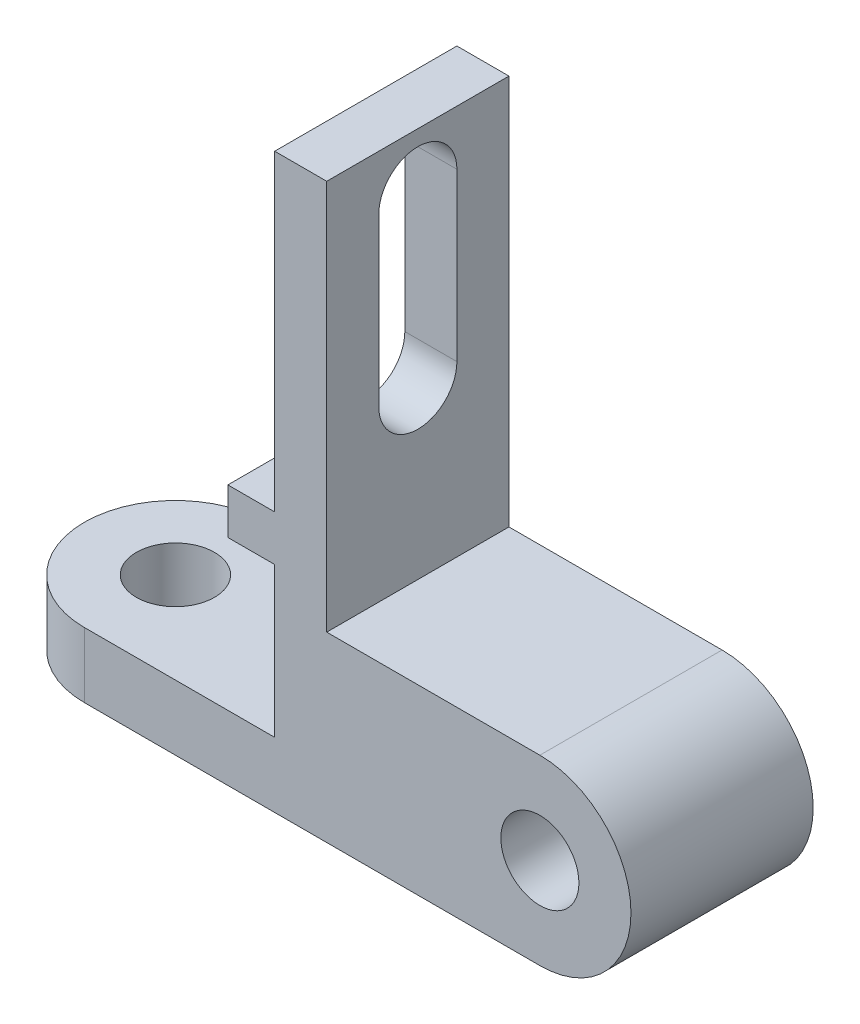
ISO-10303-21;
HEADER;
FILE_DESCRIPTION(('STEP AP214'),'2;1');
FILE_NAME('part.step','',(''),(''),'','','');
FILE_SCHEMA(('AUTOMOTIVE_DESIGN { 1 0 10303 214 1 1 1 1 }'));
ENDSEC;
DATA;
#1=APPLICATION_CONTEXT('core data for automotive mechanical design processes');
#2=APPLICATION_PROTOCOL_DEFINITION('international standard','automotive_design',2000,#1);
#3=PRODUCT_CONTEXT('',#1,'mechanical');
#4=PRODUCT('Part','Part','',(#3));
#5=PRODUCT_RELATED_PRODUCT_CATEGORY('part','',(#4));
#6=PRODUCT_DEFINITION_FORMATION('','',#4);
#7=PRODUCT_DEFINITION_CONTEXT('part definition',#1,'design');
#8=PRODUCT_DEFINITION('design','',#6,#7);
#9=PRODUCT_DEFINITION_SHAPE('','',#8);
#10=(LENGTH_UNIT() NAMED_UNIT(*) SI_UNIT(.MILLI.,.METRE.));
#11=(NAMED_UNIT(*) PLANE_ANGLE_UNIT() SI_UNIT($,.RADIAN.));
#12=(NAMED_UNIT(*) SI_UNIT($,.STERADIAN.) SOLID_ANGLE_UNIT());
#13=UNCERTAINTY_MEASURE_WITH_UNIT(LENGTH_MEASURE(1.E-05),#10,'distance_accuracy_value','');
#14=(GEOMETRIC_REPRESENTATION_CONTEXT(3) GLOBAL_UNCERTAINTY_ASSIGNED_CONTEXT((#13)) GLOBAL_UNIT_ASSIGNED_CONTEXT((#10,
#11,#12)) REPRESENTATION_CONTEXT('',''));
#15=CARTESIAN_POINT('',(0.,0.,0.));
#16=DIRECTION('',(0.,0.,1.));
#17=DIRECTION('',(1.,0.,0.));
#18=AXIS2_PLACEMENT_3D('',#15,#16,#17);
#19=CARTESIAN_POINT('',(0.,0.,14.));
#20=DIRECTION('',(0.,0.,1.));
#21=DIRECTION('',(1.,0.,0.));
#22=AXIS2_PLACEMENT_3D('',#19,#20,#21);
#23=PLANE('',#22);
#24=CARTESIAN_POINT('',(0.,0.,14.));
#25=DIRECTION('',(0.,0.,1.));
#26=DIRECTION('',(1.,0.,0.));
#27=AXIS2_PLACEMENT_3D('',#24,#25,#26);
#28=CIRCLE('',#27,14.);
#29=CARTESIAN_POINT('',(0.,-14.,14.));
#30=VERTEX_POINT('',#29);
#31=CARTESIAN_POINT('',(0.,14.,14.));
#32=VERTEX_POINT('',#31);
#33=EDGE_CURVE('E192',#30,#32,#28,.T.);
#34=ORIENTED_EDGE('',*,*,#33,.T.);
#35=DIRECTION('',(-1.,0.,0.));
#36=VECTOR('',#35,1.);
#37=CARTESIAN_POINT('',(-32.7493028128846,14.,14.));
#38=LINE('',#37,#36);
#39=CARTESIAN_POINT('',(-32.7493028128846,14.,14.));
#40=VERTEX_POINT('',#39);
#41=EDGE_CURVE('E195',#32,#40,#38,.T.);
#42=ORIENTED_EDGE('',*,*,#41,.T.);
#43=DIRECTION('',(0.,1.,0.));
#44=VECTOR('',#43,1.);
#45=CARTESIAN_POINT('',(-32.7493028128846,74.,14.));
#46=LINE('',#45,#44);
#47=CARTESIAN_POINT('',(-32.7493028128846,74.,14.));
#48=VERTEX_POINT('',#47);
#49=EDGE_CURVE('E198',#40,#48,#46,.T.);
#50=ORIENTED_EDGE('',*,*,#49,.T.);
#51=DIRECTION('',(-1.,0.,0.));
#52=VECTOR('',#51,1.);
#53=CARTESIAN_POINT('',(-40.7493028128846,74.,14.));
#54=LINE('',#53,#52);
#55=CARTESIAN_POINT('',(-40.7493028128846,74.,14.));
#56=VERTEX_POINT('',#55);
#57=EDGE_CURVE('E200',#48,#56,#54,.T.);
#58=ORIENTED_EDGE('',*,*,#57,.T.);
#59=DIRECTION('',(0.,-1.,0.));
#60=VECTOR('',#59,1.);
#61=CARTESIAN_POINT('',(-40.7493028128846,26.,14.));
#62=LINE('',#61,#60);
#63=CARTESIAN_POINT('',(-40.7493028128846,26.,14.));
#64=VERTEX_POINT('',#63);
#65=EDGE_CURVE('E202',#56,#64,#62,.T.);
#66=ORIENTED_EDGE('',*,*,#65,.T.);
#67=DIRECTION('',(-1.,0.,0.));
#68=VECTOR('',#67,1.);
#69=CARTESIAN_POINT('',(-47.9403562504525,26.,14.));
#70=LINE('',#69,#68);
#71=CARTESIAN_POINT('',(-47.9403562504525,26.,14.));
#72=VERTEX_POINT('',#71);
#73=EDGE_CURVE('E204',#64,#72,#70,.T.);
#74=ORIENTED_EDGE('',*,*,#73,.T.);
#75=DIRECTION('',(0.,-1.,0.));
#76=VECTOR('',#75,1.);
#77=CARTESIAN_POINT('',(-47.9403562504525,19.,14.));
#78=LINE('',#77,#76);
#79=CARTESIAN_POINT('',(-47.9403562504525,19.,14.));
#80=VERTEX_POINT('',#79);
#81=EDGE_CURVE('E206',#72,#80,#78,.T.);
#82=ORIENTED_EDGE('',*,*,#81,.T.);
#83=DIRECTION('',(1.,0.,0.));
#84=VECTOR('',#83,1.);
#85=CARTESIAN_POINT('',(-40.7493028128846,19.,14.));
#86=LINE('',#85,#84);
#87=CARTESIAN_POINT('',(-40.7493028128846,19.,14.));
#88=VERTEX_POINT('',#87);
#89=EDGE_CURVE('E208',#80,#88,#86,.T.);
#90=ORIENTED_EDGE('',*,*,#89,.T.);
#91=DIRECTION('',(0.,-1.,0.));
#92=VECTOR('',#91,1.);
#93=CARTESIAN_POINT('',(-40.7493028128846,-4.00000000000001,14.));
#94=LINE('',#93,#92);
#95=CARTESIAN_POINT('',(-40.7493028128846,-4.00000000000001,14.));
#96=VERTEX_POINT('',#95);
#97=EDGE_CURVE('E210',#88,#96,#94,.T.);
#98=ORIENTED_EDGE('',*,*,#97,.T.);
#99=DIRECTION('',(-1.,0.,0.));
#100=VECTOR('',#99,1.);
#101=CARTESIAN_POINT('',(-70.,-4.00000000000001,14.));
#102=LINE('',#101,#100);
#103=CARTESIAN_POINT('',(-70.,-4.00000000000001,14.));
#104=VERTEX_POINT('',#103);
#105=EDGE_CURVE('E212',#96,#104,#102,.T.);
#106=ORIENTED_EDGE('',*,*,#105,.T.);
#107=DIRECTION('',(0.,-1.,0.));
#108=VECTOR('',#107,1.);
#109=CARTESIAN_POINT('',(-70.,-14.,14.));
#110=LINE('',#109,#108);
#111=CARTESIAN_POINT('',(-70.,-14.,14.));
#112=VERTEX_POINT('',#111);
#113=EDGE_CURVE('E215',#104,#112,#110,.T.);
#114=ORIENTED_EDGE('',*,*,#113,.T.);
#115=DIRECTION('',(1.,0.,0.));
#116=VECTOR('',#115,1.);
#117=CARTESIAN_POINT('',(0.,-14.,14.));
#118=LINE('',#117,#116);
#119=EDGE_CURVE('E218',#112,#30,#118,.T.);
#120=ORIENTED_EDGE('',*,*,#119,.T.);
#121=EDGE_LOOP('',(#34,#42,#50,#58,#66,#74,#82,#90,#98,#106,#114,#120));
#122=FACE_BOUND('',#121,.T.);
#123=CARTESIAN_POINT('',(0.,0.,14.));
#124=DIRECTION('',(0.,0.,1.));
#125=DIRECTION('',(1.,0.,0.));
#126=AXIS2_PLACEMENT_3D('',#123,#124,#125);
#127=CIRCLE('',#126,6.);
#128=CARTESIAN_POINT('',(6.,0.,14.));
#129=VERTEX_POINT('',#128);
#130=EDGE_CURVE('E186',#129,#129,#127,.T.);
#131=ORIENTED_EDGE('',*,*,#130,.F.);
#132=EDGE_LOOP('',(#131));
#133=FACE_BOUND('',#132,.T.);
#134=ADVANCED_FACE('F33',(#122,#133),#23,.T.);
#135=CARTESIAN_POINT('',(0.,0.,-14.));
#136=DIRECTION('',(0.,0.,1.));
#137=DIRECTION('',(1.,0.,0.));
#138=AXIS2_PLACEMENT_3D('',#135,#136,#137);
#139=PLANE('',#138);
#140=CARTESIAN_POINT('',(0.,0.,-14.));
#141=DIRECTION('',(0.,0.,1.));
#142=DIRECTION('',(1.,0.,0.));
#143=AXIS2_PLACEMENT_3D('',#140,#141,#142);
#144=CIRCLE('',#143,14.);
#145=CARTESIAN_POINT('',(0.,-14.,-14.));
#146=VERTEX_POINT('',#145);
#147=CARTESIAN_POINT('',(0.,14.,-14.));
#148=VERTEX_POINT('',#147);
#149=EDGE_CURVE('E189',#146,#148,#144,.T.);
#150=ORIENTED_EDGE('',*,*,#149,.F.);
#151=DIRECTION('',(1.,0.,0.));
#152=VECTOR('',#151,1.);
#153=CARTESIAN_POINT('',(0.,-14.,-14.));
#154=LINE('',#153,#152);
#155=CARTESIAN_POINT('',(-70.,-14.,-14.));
#156=VERTEX_POINT('',#155);
#157=EDGE_CURVE('E196',#156,#146,#154,.T.);
#158=ORIENTED_EDGE('',*,*,#157,.F.);
#159=DIRECTION('',(0.,-1.,0.));
#160=VECTOR('',#159,1.);
#161=CARTESIAN_POINT('',(-70.,-14.,-14.));
#162=LINE('',#161,#160);
#163=CARTESIAN_POINT('',(-70.,-4.00000000000001,-14.));
#164=VERTEX_POINT('',#163);
#165=EDGE_CURVE('E242',#164,#156,#162,.T.);
#166=ORIENTED_EDGE('',*,*,#165,.F.);
#167=DIRECTION('',(-1.,0.,0.));
#168=VECTOR('',#167,1.);
#169=CARTESIAN_POINT('',(-70.,-4.00000000000001,-14.));
#170=LINE('',#169,#168);
#171=CARTESIAN_POINT('',(-40.7493028128846,-4.00000000000001,-14.));
#172=VERTEX_POINT('',#171);
#173=EDGE_CURVE('E239',#172,#164,#170,.T.);
#174=ORIENTED_EDGE('',*,*,#173,.F.);
#175=DIRECTION('',(0.,-1.,0.));
#176=VECTOR('',#175,1.);
#177=CARTESIAN_POINT('',(-40.7493028128846,-4.00000000000001,-14.));
#178=LINE('',#177,#176);
#179=CARTESIAN_POINT('',(-40.7493028128846,19.,-14.));
#180=VERTEX_POINT('',#179);
#181=EDGE_CURVE('E237',#180,#172,#178,.T.);
#182=ORIENTED_EDGE('',*,*,#181,.F.);
#183=DIRECTION('',(1.,0.,0.));
#184=VECTOR('',#183,1.);
#185=CARTESIAN_POINT('',(-40.7493028128846,19.,-14.));
#186=LINE('',#185,#184);
#187=CARTESIAN_POINT('',(-47.9403562504525,19.,-14.));
#188=VERTEX_POINT('',#187);
#189=EDGE_CURVE('E235',#188,#180,#186,.T.);
#190=ORIENTED_EDGE('',*,*,#189,.F.);
#191=DIRECTION('',(0.,-1.,0.));
#192=VECTOR('',#191,1.);
#193=CARTESIAN_POINT('',(-47.9403562504525,19.,-14.));
#194=LINE('',#193,#192);
#195=CARTESIAN_POINT('',(-47.9403562504525,26.,-14.));
#196=VERTEX_POINT('',#195);
#197=EDGE_CURVE('E233',#196,#188,#194,.T.);
#198=ORIENTED_EDGE('',*,*,#197,.F.);
#199=DIRECTION('',(-1.,0.,0.));
#200=VECTOR('',#199,1.);
#201=CARTESIAN_POINT('',(-47.9403562504525,26.,-14.));
#202=LINE('',#201,#200);
#203=CARTESIAN_POINT('',(-40.7493028128846,26.,-14.));
#204=VERTEX_POINT('',#203);
#205=EDGE_CURVE('E231',#204,#196,#202,.T.);
#206=ORIENTED_EDGE('',*,*,#205,.F.);
#207=DIRECTION('',(0.,-1.,0.));
#208=VECTOR('',#207,1.);
#209=CARTESIAN_POINT('',(-40.7493028128846,26.,-14.));
#210=LINE('',#209,#208);
#211=CARTESIAN_POINT('',(-40.7493028128846,74.,-14.));
#212=VERTEX_POINT('',#211);
#213=EDGE_CURVE('E229',#212,#204,#210,.T.);
#214=ORIENTED_EDGE('',*,*,#213,.F.);
#215=DIRECTION('',(-1.,0.,0.));
#216=VECTOR('',#215,1.);
#217=CARTESIAN_POINT('',(-40.7493028128846,74.,-14.));
#218=LINE('',#217,#216);
#219=CARTESIAN_POINT('',(-32.7493028128846,74.,-14.));
#220=VERTEX_POINT('',#219);
#221=EDGE_CURVE('E227',#220,#212,#218,.T.);
#222=ORIENTED_EDGE('',*,*,#221,.F.);
#223=DIRECTION('',(0.,1.,0.));
#224=VECTOR('',#223,1.);
#225=CARTESIAN_POINT('',(-32.7493028128846,74.,-14.));
#226=LINE('',#225,#224);
#227=CARTESIAN_POINT('',(-32.7493028128846,14.,-14.));
#228=VERTEX_POINT('',#227);
#229=EDGE_CURVE('E225',#228,#220,#226,.T.);
#230=ORIENTED_EDGE('',*,*,#229,.F.);
#231=DIRECTION('',(-1.,0.,0.));
#232=VECTOR('',#231,1.);
#233=CARTESIAN_POINT('',(-32.7493028128846,14.,-14.));
#234=LINE('',#233,#232);
#235=EDGE_CURVE('E223',#148,#228,#234,.T.);
#236=ORIENTED_EDGE('',*,*,#235,.F.);
#237=EDGE_LOOP('',(#150,#158,#166,#174,#182,#190,#198,#206,#214,#222,#230,#236));
#238=FACE_BOUND('',#237,.T.);
#239=CARTESIAN_POINT('',(0.,0.,-14.));
#240=DIRECTION('',(0.,0.,1.));
#241=DIRECTION('',(1.,0.,0.));
#242=AXIS2_PLACEMENT_3D('',#239,#240,#241);
#243=CIRCLE('',#242,6.);
#244=CARTESIAN_POINT('',(6.,0.,-14.));
#245=VERTEX_POINT('',#244);
#246=EDGE_CURVE('E183',#245,#245,#243,.T.);
#247=ORIENTED_EDGE('',*,*,#246,.T.);
#248=EDGE_LOOP('',(#247));
#249=FACE_BOUND('',#248,.T.);
#250=ADVANCED_FACE('F298',(#238,#249),#139,.F.);
#251=CARTESIAN_POINT('',(0.,0.,14.));
#252=DIRECTION('',(0.,0.,-1.));
#253=DIRECTION('',(-1.,0.,0.));
#254=AXIS2_PLACEMENT_3D('',#251,#252,#253);
#255=CYLINDRICAL_SURFACE('',#254,14.);
#256=ORIENTED_EDGE('',*,*,#149,.T.);
#257=DIRECTION('',(0.,0.,-1.));
#258=VECTOR('',#257,1.);
#259=CARTESIAN_POINT('',(0.,14.,14.));
#260=LINE('',#259,#258);
#261=EDGE_CURVE('E272',#32,#148,#260,.T.);
#262=ORIENTED_EDGE('',*,*,#261,.F.);
#263=ORIENTED_EDGE('',*,*,#33,.F.);
#264=DIRECTION('',(0.,0.,-1.));
#265=VECTOR('',#264,1.);
#266=CARTESIAN_POINT('',(0.,-14.,14.));
#267=LINE('',#266,#265);
#268=EDGE_CURVE('E220',#30,#146,#267,.T.);
#269=ORIENTED_EDGE('',*,*,#268,.T.);
#270=EDGE_LOOP('',(#256,#262,#263,#269));
#271=FACE_BOUND('',#270,.T.);
#272=ADVANCED_FACE('F35',(#271),#255,.T.);
#273=CARTESIAN_POINT('',(-32.7493028128846,14.,14.));
#274=DIRECTION('',(0.,-1.,0.));
#275=DIRECTION('',(0.,0.,-1.));
#276=AXIS2_PLACEMENT_3D('',#273,#274,#275);
#277=PLANE('',#276);
#278=ORIENTED_EDGE('',*,*,#235,.T.);
#279=DIRECTION('',(0.,0.,-1.));
#280=VECTOR('',#279,1.);
#281=CARTESIAN_POINT('',(-32.7493028128846,14.,14.));
#282=LINE('',#281,#280);
#283=EDGE_CURVE('E269',#40,#228,#282,.T.);
#284=ORIENTED_EDGE('',*,*,#283,.F.);
#285=ORIENTED_EDGE('',*,*,#41,.F.);
#286=ORIENTED_EDGE('',*,*,#261,.T.);
#287=EDGE_LOOP('',(#278,#284,#285,#286));
#288=FACE_BOUND('',#287,.T.);
#289=ADVANCED_FACE('F342',(#288),#277,.F.);
#290=CARTESIAN_POINT('',(-32.7493028128846,74.,14.));
#291=DIRECTION('',(-1.,0.,0.));
#292=DIRECTION('',(0.,-1.,0.));
#293=AXIS2_PLACEMENT_3D('',#290,#291,#292);
#294=PLANE('',#293);
#295=DIRECTION('',(0.,-1.,0.));
#296=VECTOR('',#295,1.);
#297=CARTESIAN_POINT('',(-32.7493028128846,65.5982788726679,6.));
#298=LINE('',#297,#296);
#299=CARTESIAN_POINT('',(-32.7493028128846,65.5982788726679,6.));
#300=VERTEX_POINT('',#299);
#301=CARTESIAN_POINT('',(-32.7493028128846,40.,6.));
#302=VERTEX_POINT('',#301);
#303=EDGE_CURVE('E158',#300,#302,#298,.T.);
#304=ORIENTED_EDGE('',*,*,#303,.F.);
#305=CARTESIAN_POINT('',(-32.7493028128846,65.5982788726679,0.));
#306=DIRECTION('',(1.,0.,0.));
#307=DIRECTION('',(0.,1.,0.));
#308=AXIS2_PLACEMENT_3D('',#305,#306,#307);
#309=CIRCLE('',#308,6.);
#310=CARTESIAN_POINT('',(-32.7493028128846,65.5982788726679,-6.));
#311=VERTEX_POINT('',#310);
#312=EDGE_CURVE('E48',#311,#300,#309,.T.);
#313=ORIENTED_EDGE('',*,*,#312,.F.);
#314=DIRECTION('',(0.,1.,0.));
#315=VECTOR('',#314,1.);
#316=CARTESIAN_POINT('',(-32.7493028128846,65.5982788726679,-6.));
#317=LINE('',#316,#315);
#318=CARTESIAN_POINT('',(-32.7493028128846,40.,-6.));
#319=VERTEX_POINT('',#318);
#320=EDGE_CURVE('E165',#319,#311,#317,.T.);
#321=ORIENTED_EDGE('',*,*,#320,.F.);
#322=CARTESIAN_POINT('',(-32.7493028128846,40.,0.));
#323=DIRECTION('',(1.,0.,0.));
#324=DIRECTION('',(0.,1.,0.));
#325=AXIS2_PLACEMENT_3D('',#322,#323,#324);
#326=CIRCLE('',#325,6.);
#327=EDGE_CURVE('E149',#302,#319,#326,.T.);
#328=ORIENTED_EDGE('',*,*,#327,.F.);
#329=EDGE_LOOP('',(#304,#313,#321,#328));
#330=FACE_BOUND('',#329,.T.);
#331=ORIENTED_EDGE('',*,*,#229,.T.);
#332=DIRECTION('',(0.,0.,-1.));
#333=VECTOR('',#332,1.);
#334=CARTESIAN_POINT('',(-32.7493028128846,74.,14.));
#335=LINE('',#334,#333);
#336=EDGE_CURVE('E266',#48,#220,#335,.T.);
#337=ORIENTED_EDGE('',*,*,#336,.F.);
#338=ORIENTED_EDGE('',*,*,#49,.F.);
#339=ORIENTED_EDGE('',*,*,#283,.T.);
#340=EDGE_LOOP('',(#331,#337,#338,#339));
#341=FACE_BOUND('',#340,.T.);
#342=ADVANCED_FACE('F162',(#330,#341),#294,.F.);
#343=CARTESIAN_POINT('',(-40.7493028128846,74.,14.));
#344=DIRECTION('',(0.,-1.,0.));
#345=DIRECTION('',(0.,0.,-1.));
#346=AXIS2_PLACEMENT_3D('',#343,#344,#345);
#347=PLANE('',#346);
#348=ORIENTED_EDGE('',*,*,#221,.T.);
#349=DIRECTION('',(0.,0.,-1.));
#350=VECTOR('',#349,1.);
#351=CARTESIAN_POINT('',(-40.7493028128846,74.,14.));
#352=LINE('',#351,#350);
#353=EDGE_CURVE('E263',#56,#212,#352,.T.);
#354=ORIENTED_EDGE('',*,*,#353,.F.);
#355=ORIENTED_EDGE('',*,*,#57,.F.);
#356=ORIENTED_EDGE('',*,*,#336,.T.);
#357=EDGE_LOOP('',(#348,#354,#355,#356));
#358=FACE_BOUND('',#357,.T.);
#359=ADVANCED_FACE('F337',(#358),#347,.F.);
#360=CARTESIAN_POINT('',(-40.7493028128846,26.,14.));
#361=DIRECTION('',(1.,0.,0.));
#362=DIRECTION('',(0.,1.,0.));
#363=AXIS2_PLACEMENT_3D('',#360,#361,#362);
#364=PLANE('',#363);
#365=DIRECTION('',(0.,1.,0.));
#366=VECTOR('',#365,1.);
#367=CARTESIAN_POINT('',(-40.7493028128846,26.,-6.));
#368=LINE('',#367,#366);
#369=CARTESIAN_POINT('',(-40.7493028128846,40.,-6.));
#370=VERTEX_POINT('',#369);
#371=CARTESIAN_POINT('',(-40.7493028128846,65.5982788726679,-6.));
#372=VERTEX_POINT('',#371);
#373=EDGE_CURVE('E41',#370,#372,#368,.T.);
#374=ORIENTED_EDGE('',*,*,#373,.T.);
#375=CARTESIAN_POINT('',(-40.7493028128846,65.5982788726679,0.));
#376=DIRECTION('',(1.,0.,0.));
#377=DIRECTION('',(0.,1.,0.));
#378=AXIS2_PLACEMENT_3D('',#375,#376,#377);
#379=CIRCLE('',#378,6.);
#380=CARTESIAN_POINT('',(-40.7493028128846,65.5982788726679,6.));
#381=VERTEX_POINT('',#380);
#382=EDGE_CURVE('E11',#372,#381,#379,.T.);
#383=ORIENTED_EDGE('',*,*,#382,.T.);
#384=DIRECTION('',(0.,-1.,0.));
#385=VECTOR('',#384,1.);
#386=CARTESIAN_POINT('',(-40.7493028128846,26.,6.));
#387=LINE('',#386,#385);
#388=CARTESIAN_POINT('',(-40.7493028128846,40.,6.));
#389=VERTEX_POINT('',#388);
#390=EDGE_CURVE('E275',#381,#389,#387,.T.);
#391=ORIENTED_EDGE('',*,*,#390,.T.);
#392=CARTESIAN_POINT('',(-40.7493028128846,40.,0.));
#393=DIRECTION('',(1.,0.,0.));
#394=DIRECTION('',(0.,1.,0.));
#395=AXIS2_PLACEMENT_3D('',#392,#393,#394);
#396=CIRCLE('',#395,6.);
#397=EDGE_CURVE('E152',#389,#370,#396,.T.);
#398=ORIENTED_EDGE('',*,*,#397,.T.);
#399=EDGE_LOOP('',(#374,#383,#391,#398));
#400=FACE_BOUND('',#399,.T.);
#401=ORIENTED_EDGE('',*,*,#213,.T.);
#402=DIRECTION('',(0.,0.,-1.));
#403=VECTOR('',#402,1.);
#404=CARTESIAN_POINT('',(-40.7493028128846,26.,14.));
#405=LINE('',#404,#403);
#406=EDGE_CURVE('E260',#64,#204,#405,.T.);
#407=ORIENTED_EDGE('',*,*,#406,.F.);
#408=ORIENTED_EDGE('',*,*,#65,.F.);
#409=ORIENTED_EDGE('',*,*,#353,.T.);
#410=EDGE_LOOP('',(#401,#407,#408,#409));
#411=FACE_BOUND('',#410,.T.);
#412=ADVANCED_FACE('F279',(#400,#411),#364,.F.);
#413=CARTESIAN_POINT('',(-47.9403562504525,26.,14.));
#414=DIRECTION('',(0.,-1.,0.));
#415=DIRECTION('',(0.,0.,-1.));
#416=AXIS2_PLACEMENT_3D('',#413,#414,#415);
#417=PLANE('',#416);
#418=ORIENTED_EDGE('',*,*,#205,.T.);
#419=DIRECTION('',(0.,0.,-1.));
#420=VECTOR('',#419,1.);
#421=CARTESIAN_POINT('',(-47.9403562504525,26.,14.));
#422=LINE('',#421,#420);
#423=EDGE_CURVE('E257',#72,#196,#422,.T.);
#424=ORIENTED_EDGE('',*,*,#423,.F.);
#425=ORIENTED_EDGE('',*,*,#73,.F.);
#426=ORIENTED_EDGE('',*,*,#406,.T.);
#427=EDGE_LOOP('',(#418,#424,#425,#426));
#428=FACE_BOUND('',#427,.T.);
#429=ADVANCED_FACE('F330',(#428),#417,.F.);
#430=CARTESIAN_POINT('',(-47.9403562504525,19.,14.));
#431=DIRECTION('',(1.,0.,0.));
#432=DIRECTION('',(0.,0.,-1.));
#433=AXIS2_PLACEMENT_3D('',#430,#431,#432);
#434=PLANE('',#433);
#435=ORIENTED_EDGE('',*,*,#197,.T.);
#436=DIRECTION('',(0.,0.,-1.));
#437=VECTOR('',#436,1.);
#438=CARTESIAN_POINT('',(-47.9403562504525,19.,14.));
#439=LINE('',#438,#437);
#440=EDGE_CURVE('E254',#80,#188,#439,.T.);
#441=ORIENTED_EDGE('',*,*,#440,.F.);
#442=ORIENTED_EDGE('',*,*,#81,.F.);
#443=ORIENTED_EDGE('',*,*,#423,.T.);
#444=EDGE_LOOP('',(#435,#441,#442,#443));
#445=FACE_BOUND('',#444,.T.);
#446=ADVANCED_FACE('F326',(#445),#434,.F.);
#447=CARTESIAN_POINT('',(-40.7493028128846,19.,14.));
#448=DIRECTION('',(0.,1.,0.));
#449=DIRECTION('',(-1.,0.,0.));
#450=AXIS2_PLACEMENT_3D('',#447,#448,#449);
#451=PLANE('',#450);
#452=ORIENTED_EDGE('',*,*,#189,.T.);
#453=DIRECTION('',(0.,0.,-1.));
#454=VECTOR('',#453,1.);
#455=CARTESIAN_POINT('',(-40.7493028128846,19.,14.));
#456=LINE('',#455,#454);
#457=EDGE_CURVE('E251',#88,#180,#456,.T.);
#458=ORIENTED_EDGE('',*,*,#457,.F.);
#459=ORIENTED_EDGE('',*,*,#89,.F.);
#460=ORIENTED_EDGE('',*,*,#440,.T.);
#461=EDGE_LOOP('',(#452,#458,#459,#460));
#462=FACE_BOUND('',#461,.T.);
#463=ADVANCED_FACE('F322',(#462),#451,.F.);
#464=CARTESIAN_POINT('',(-40.7493028128846,-4.00000000000001,14.));
#465=DIRECTION('',(1.,0.,0.));
#466=DIRECTION('',(0.,0.,-1.));
#467=AXIS2_PLACEMENT_3D('',#464,#465,#466);
#468=PLANE('',#467);
#469=ORIENTED_EDGE('',*,*,#181,.T.);
#470=DIRECTION('',(0.,0.,-1.));
#471=VECTOR('',#470,1.);
#472=CARTESIAN_POINT('',(-40.7493028128846,-4.00000000000001,14.));
#473=LINE('',#472,#471);
#474=EDGE_CURVE('E248',#96,#172,#473,.T.);
#475=ORIENTED_EDGE('',*,*,#474,.F.);
#476=ORIENTED_EDGE('',*,*,#97,.F.);
#477=ORIENTED_EDGE('',*,*,#457,.T.);
#478=EDGE_LOOP('',(#469,#475,#476,#477));
#479=FACE_BOUND('',#478,.T.);
#480=ADVANCED_FACE('F318',(#479),#468,.F.);
#481=CARTESIAN_POINT('',(-70.,-4.00000000000001,14.));
#482=DIRECTION('',(0.,-1.,0.));
#483=DIRECTION('',(0.,0.,-1.));
#484=AXIS2_PLACEMENT_3D('',#481,#482,#483);
#485=PLANE('',#484);
#486=CARTESIAN_POINT('',(-70.,-4.00000000000001,0.));
#487=DIRECTION('',(0.,1.,0.));
#488=DIRECTION('',(0.,0.,1.));
#489=AXIS2_PLACEMENT_3D('',#486,#487,#488);
#490=CIRCLE('',#489,6.);
#491=CARTESIAN_POINT('',(-70.,-4.00000000000001,6.));
#492=VERTEX_POINT('',#491);
#493=EDGE_CURVE('E172',#492,#492,#490,.T.);
#494=ORIENTED_EDGE('',*,*,#493,.F.);
#495=EDGE_LOOP('',(#494));
#496=FACE_BOUND('',#495,.T.);
#497=ORIENTED_EDGE('',*,*,#173,.T.);
#498=CARTESIAN_POINT('',(-70.,-4.00000000000001,0.));
#499=DIRECTION('',(0.,1.,0.));
#500=DIRECTION('',(0.,0.,1.));
#501=AXIS2_PLACEMENT_3D('',#498,#499,#500);
#502=CIRCLE('',#501,14.);
#503=EDGE_CURVE('E178',#164,#104,#502,.T.);
#504=ORIENTED_EDGE('',*,*,#503,.T.);
#505=ORIENTED_EDGE('',*,*,#105,.F.);
#506=ORIENTED_EDGE('',*,*,#474,.T.);
#507=EDGE_LOOP('',(#497,#504,#505,#506));
#508=FACE_BOUND('',#507,.T.);
#509=ADVANCED_FACE('F314',(#496,#508),#485,.F.);
#510=CARTESIAN_POINT('',(0.,-14.,14.));
#511=DIRECTION('',(0.,1.,0.));
#512=DIRECTION('',(-1.,0.,0.));
#513=AXIS2_PLACEMENT_3D('',#510,#511,#512);
#514=PLANE('',#513);
#515=CARTESIAN_POINT('',(-70.,-14.,0.));
#516=DIRECTION('',(0.,1.,0.));
#517=DIRECTION('',(0.,0.,1.));
#518=AXIS2_PLACEMENT_3D('',#515,#516,#517);
#519=CIRCLE('',#518,6.);
#520=CARTESIAN_POINT('',(-70.,-14.,6.));
#521=VERTEX_POINT('',#520);
#522=EDGE_CURVE('E175',#521,#521,#519,.T.);
#523=ORIENTED_EDGE('',*,*,#522,.T.);
#524=EDGE_LOOP('',(#523));
#525=FACE_BOUND('',#524,.T.);
#526=ORIENTED_EDGE('',*,*,#157,.T.);
#527=ORIENTED_EDGE('',*,*,#268,.F.);
#528=ORIENTED_EDGE('',*,*,#119,.F.);
#529=CARTESIAN_POINT('',(-70.,-14.,0.));
#530=DIRECTION('',(0.,1.,0.));
#531=DIRECTION('',(0.,0.,1.));
#532=AXIS2_PLACEMENT_3D('',#529,#530,#531);
#533=CIRCLE('',#532,14.);
#534=EDGE_CURVE('E181',#156,#112,#533,.T.);
#535=ORIENTED_EDGE('',*,*,#534,.F.);
#536=EDGE_LOOP('',(#526,#527,#528,#535));
#537=FACE_BOUND('',#536,.T.);
#538=ADVANCED_FACE('F311',(#525,#537),#514,.F.);
#539=CARTESIAN_POINT('',(0.,0.,14.));
#540=DIRECTION('',(0.,0.,-1.));
#541=DIRECTION('',(-1.,0.,0.));
#542=AXIS2_PLACEMENT_3D('',#539,#540,#541);
#543=CYLINDRICAL_SURFACE('',#542,6.);
#544=ORIENTED_EDGE('',*,*,#130,.T.);
#545=EDGE_LOOP('',(#544));
#546=FACE_BOUND('',#545,.T.);
#547=ORIENTED_EDGE('',*,*,#246,.F.);
#548=EDGE_LOOP('',(#547));
#549=FACE_BOUND('',#548,.T.);
#550=ADVANCED_FACE('F308',(#546,#549),#543,.F.);
#551=CARTESIAN_POINT('',(-70.,-14.,0.));
#552=DIRECTION('',(0.,1.,0.));
#553=DIRECTION('',(0.,0.,1.));
#554=AXIS2_PLACEMENT_3D('',#551,#552,#553);
#555=CYLINDRICAL_SURFACE('',#554,14.);
#556=ORIENTED_EDGE('',*,*,#503,.F.);
#557=ORIENTED_EDGE('',*,*,#165,.T.);
#558=ORIENTED_EDGE('',*,*,#534,.T.);
#559=ORIENTED_EDGE('',*,*,#113,.F.);
#560=EDGE_LOOP('',(#556,#557,#558,#559));
#561=FACE_BOUND('',#560,.T.);
#562=ADVANCED_FACE('F293',(#561),#555,.T.);
#563=CARTESIAN_POINT('',(-70.,-14.,0.));
#564=DIRECTION('',(0.,1.,0.));
#565=DIRECTION('',(0.,0.,1.));
#566=AXIS2_PLACEMENT_3D('',#563,#564,#565);
#567=CYLINDRICAL_SURFACE('',#566,6.);
#568=ORIENTED_EDGE('',*,*,#522,.F.);
#569=EDGE_LOOP('',(#568));
#570=FACE_BOUND('',#569,.T.);
#571=ORIENTED_EDGE('',*,*,#493,.T.);
#572=EDGE_LOOP('',(#571));
#573=FACE_BOUND('',#572,.T.);
#574=ADVANCED_FACE('F286',(#570,#573),#567,.F.);
#575=CARTESIAN_POINT('',(-42.7493028128846,65.5982788726679,0.));
#576=DIRECTION('',(1.,0.,0.));
#577=DIRECTION('',(0.,1.,0.));
#578=AXIS2_PLACEMENT_3D('',#575,#576,#577);
#579=CYLINDRICAL_SURFACE('',#578,6.);
#580=DIRECTION('',(1.,0.,0.));
#581=VECTOR('',#580,1.);
#582=CARTESIAN_POINT('',(-42.7493028128846,65.5982788726679,-6.));
#583=LINE('',#582,#581);
#584=EDGE_CURVE('E170',#372,#311,#583,.T.);
#585=ORIENTED_EDGE('',*,*,#584,.T.);
#586=ORIENTED_EDGE('',*,*,#312,.T.);
#587=DIRECTION('',(1.,0.,0.));
#588=VECTOR('',#587,1.);
#589=CARTESIAN_POINT('',(-42.7493028128846,65.5982788726679,6.));
#590=LINE('',#589,#588);
#591=EDGE_CURVE('E155',#381,#300,#590,.T.);
#592=ORIENTED_EDGE('',*,*,#591,.F.);
#593=ORIENTED_EDGE('',*,*,#382,.F.);
#594=EDGE_LOOP('',(#585,#586,#592,#593));
#595=FACE_BOUND('',#594,.T.);
#596=ADVANCED_FACE('F284',(#595),#579,.F.);
#597=CARTESIAN_POINT('',(-42.7493028128846,65.5982788726679,-6.));
#598=DIRECTION('',(0.,0.,-1.));
#599=DIRECTION('',(0.,1.,0.));
#600=AXIS2_PLACEMENT_3D('',#597,#598,#599);
#601=PLANE('',#600);
#602=DIRECTION('',(1.,0.,0.));
#603=VECTOR('',#602,1.);
#604=CARTESIAN_POINT('',(-42.7493028128846,40.,-6.));
#605=LINE('',#604,#603);
#606=EDGE_CURVE('E154',#370,#319,#605,.T.);
#607=ORIENTED_EDGE('',*,*,#606,.T.);
#608=ORIENTED_EDGE('',*,*,#320,.T.);
#609=ORIENTED_EDGE('',*,*,#584,.F.);
#610=ORIENTED_EDGE('',*,*,#373,.F.);
#611=EDGE_LOOP('',(#607,#608,#609,#610));
#612=FACE_BOUND('',#611,.T.);
#613=ADVANCED_FACE('F283',(#612),#601,.F.);
#614=CARTESIAN_POINT('',(-42.7493028128846,40.,0.));
#615=DIRECTION('',(1.,0.,0.));
#616=DIRECTION('',(0.,1.,0.));
#617=AXIS2_PLACEMENT_3D('',#614,#615,#616);
#618=CYLINDRICAL_SURFACE('',#617,6.);
#619=DIRECTION('',(1.,0.,0.));
#620=VECTOR('',#619,1.);
#621=CARTESIAN_POINT('',(-42.7493028128846,40.,6.));
#622=LINE('',#621,#620);
#623=EDGE_CURVE('E56',#389,#302,#622,.T.);
#624=ORIENTED_EDGE('',*,*,#623,.T.);
#625=ORIENTED_EDGE('',*,*,#327,.T.);
#626=ORIENTED_EDGE('',*,*,#606,.F.);
#627=ORIENTED_EDGE('',*,*,#397,.F.);
#628=EDGE_LOOP('',(#624,#625,#626,#627));
#629=FACE_BOUND('',#628,.T.);
#630=ADVANCED_FACE('F146',(#629),#618,.F.);
#631=CARTESIAN_POINT('',(-42.7493028128846,65.5982788726679,6.));
#632=DIRECTION('',(0.,0.,1.));
#633=DIRECTION('',(0.,-1.,0.));
#634=AXIS2_PLACEMENT_3D('',#631,#632,#633);
#635=PLANE('',#634);
#636=ORIENTED_EDGE('',*,*,#591,.T.);
#637=ORIENTED_EDGE('',*,*,#303,.T.);
#638=ORIENTED_EDGE('',*,*,#623,.F.);
#639=ORIENTED_EDGE('',*,*,#390,.F.);
#640=EDGE_LOOP('',(#636,#637,#638,#639));
#641=FACE_BOUND('',#640,.T.);
#642=ADVANCED_FACE('F159',(#641),#635,.F.);
#643=CLOSED_SHELL('',(#134,#250,#272,#289,#342,#359,#412,#429,#446,#463,#480,#509,#538,#550,
#562,#574,#596,#613,#630,#642));
#644=MANIFOLD_SOLID_BREP('B2',#643);
#645=ADVANCED_BREP_SHAPE_REPRESENTATION('',(#18,#644),#14);
#646=SHAPE_DEFINITION_REPRESENTATION(#9,#645);
ENDSEC;
END-ISO-10303-21;
